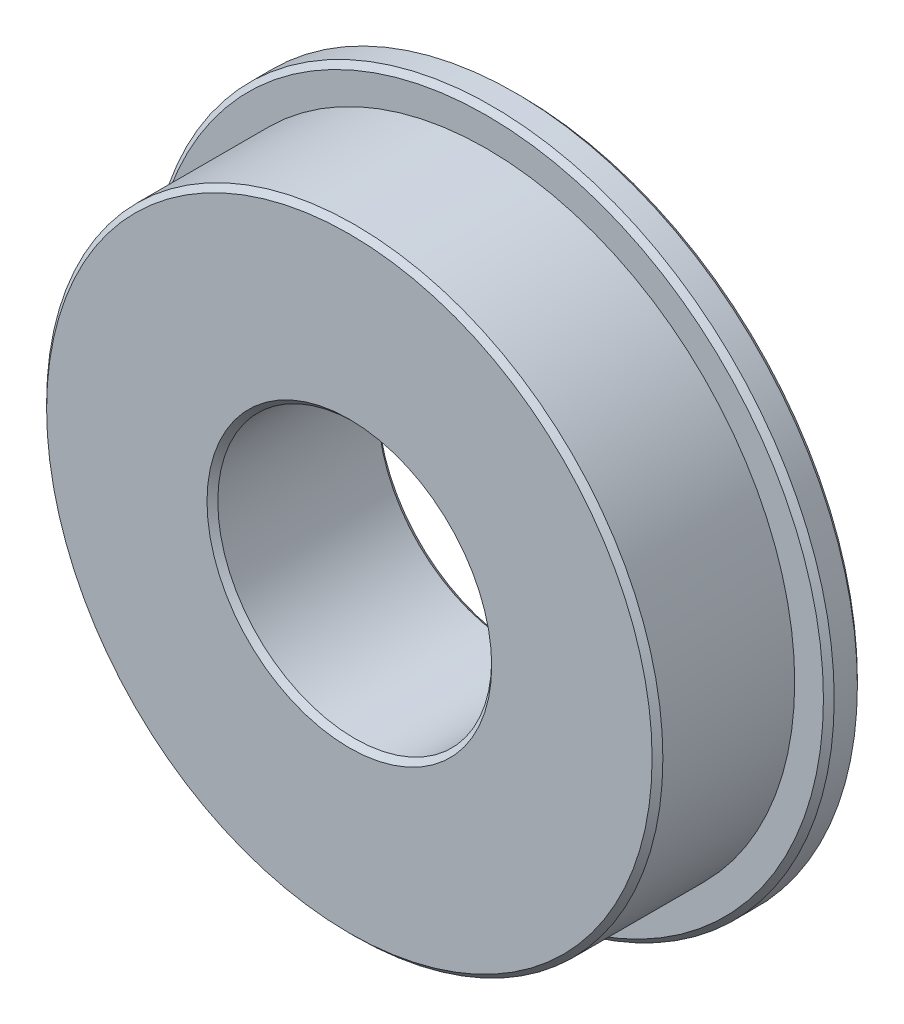
ISO-10303-21;
HEADER;
FILE_DESCRIPTION(('STEP AP214'),'2;1');
FILE_NAME('part.step','',(''),(''),'','','');
FILE_SCHEMA(('AUTOMOTIVE_DESIGN { 1 0 10303 214 1 1 1 1 }'));
ENDSEC;
DATA;
#1=APPLICATION_CONTEXT('core data for automotive mechanical design processes');
#2=APPLICATION_PROTOCOL_DEFINITION('international standard','automotive_design',2000,#1);
#3=PRODUCT_CONTEXT('',#1,'mechanical');
#4=PRODUCT('Part','Part','',(#3));
#5=PRODUCT_RELATED_PRODUCT_CATEGORY('part','',(#4));
#6=PRODUCT_DEFINITION_FORMATION('','',#4);
#7=PRODUCT_DEFINITION_CONTEXT('part definition',#1,'design');
#8=PRODUCT_DEFINITION('design','',#6,#7);
#9=PRODUCT_DEFINITION_SHAPE('','',#8);
#10=(LENGTH_UNIT() NAMED_UNIT(*) SI_UNIT(.MILLI.,.METRE.));
#11=(NAMED_UNIT(*) PLANE_ANGLE_UNIT() SI_UNIT($,.RADIAN.));
#12=(NAMED_UNIT(*) SI_UNIT($,.STERADIAN.) SOLID_ANGLE_UNIT());
#13=UNCERTAINTY_MEASURE_WITH_UNIT(LENGTH_MEASURE(1.E-05),#10,'distance_accuracy_value','');
#14=(GEOMETRIC_REPRESENTATION_CONTEXT(3) GLOBAL_UNCERTAINTY_ASSIGNED_CONTEXT((#13)) GLOBAL_UNIT_ASSIGNED_CONTEXT((#10,
#11,#12)) REPRESENTATION_CONTEXT('',''));
#15=CARTESIAN_POINT('',(0.,0.,0.));
#16=DIRECTION('',(0.,0.,1.));
#17=DIRECTION('',(1.,0.,0.));
#18=AXIS2_PLACEMENT_3D('',#15,#16,#17);
#19=CARTESIAN_POINT('',(-15.8687544862297,0.,-6.36269929073161));
#20=DIRECTION('',(0.,0.,-1.));
#21=DIRECTION('',(-1.,0.,0.));
#22=AXIS2_PLACEMENT_3D('',#19,#20,#21);
#23=PLANE('',#22);
#24=CARTESIAN_POINT('',(0.,0.,-6.36269929073161));
#25=DIRECTION('',(0.,0.,-1.));
#26=DIRECTION('',(-1.,0.,0.));
#27=AXIS2_PLACEMENT_3D('',#24,#25,#26);
#28=CIRCLE('',#27,15.6187544862297);
#29=CARTESIAN_POINT('',(-15.6187544862297,0.,-6.36269929073161));
#30=VERTEX_POINT('',#29);
#31=EDGE_CURVE('E10',#30,#30,#28,.F.);
#32=ORIENTED_EDGE('',*,*,#31,.T.);
#33=EDGE_LOOP('',(#32));
#34=FACE_BOUND('',#33,.T.);
#35=CARTESIAN_POINT('',(0.,0.,-6.36269929073161));
#36=DIRECTION('',(0.,0.,1.));
#37=DIRECTION('',(1.,0.,0.));
#38=AXIS2_PLACEMENT_3D('',#35,#36,#37);
#39=CIRCLE('',#38,14.2874972889093);
#40=CARTESIAN_POINT('',(14.2874972889093,0.,-6.36269929073161));
#41=VERTEX_POINT('',#40);
#42=EDGE_CURVE('E70',#41,#41,#39,.T.);
#43=ORIENTED_EDGE('',*,*,#42,.F.);
#44=EDGE_LOOP('',(#43));
#45=FACE_BOUND('',#44,.T.);
#46=ADVANCED_FACE('F32',(#34,#45),#23,.F.);
#47=CARTESIAN_POINT('',(0.,0.,0.));
#48=DIRECTION('',(0.,0.,1.));
#49=DIRECTION('',(1.,0.,0.));
#50=AXIS2_PLACEMENT_3D('',#47,#48,#49);
#51=CYLINDRICAL_SURFACE('',#50,15.8687544862297);
#52=CARTESIAN_POINT('',(0.,0.,-7.6874992907315));
#53=DIRECTION('',(0.,0.,1.));
#54=DIRECTION('',(1.,0.,0.));
#55=AXIS2_PLACEMENT_3D('',#52,#53,#54);
#56=CIRCLE('',#55,15.8687544862297);
#57=CARTESIAN_POINT('',(15.8687544862297,0.,-7.6874992907315));
#58=VERTEX_POINT('',#57);
#59=EDGE_CURVE('E39',#58,#58,#56,.T.);
#60=ORIENTED_EDGE('',*,*,#59,.T.);
#61=EDGE_LOOP('',(#60));
#62=FACE_BOUND('',#61,.T.);
#63=CARTESIAN_POINT('',(0.,0.,-6.61269929073161));
#64=DIRECTION('',(0.,0.,-1.));
#65=DIRECTION('',(-1.,0.,0.));
#66=AXIS2_PLACEMENT_3D('',#63,#64,#65);
#67=CIRCLE('',#66,15.8687544862297);
#68=CARTESIAN_POINT('',(-15.8687544862297,0.,-6.61269929073161));
#69=VERTEX_POINT('',#68);
#70=EDGE_CURVE('E43',#69,#69,#67,.T.);
#71=ORIENTED_EDGE('',*,*,#70,.T.);
#72=EDGE_LOOP('',(#71));
#73=FACE_BOUND('',#72,.T.);
#74=ADVANCED_FACE('F77',(#62,#73),#51,.T.);
#75=CARTESIAN_POINT('',(-6.34999793673862,0.,-7.93749929073151));
#76=DIRECTION('',(0.,0.,1.));
#77=DIRECTION('',(1.,0.,0.));
#78=AXIS2_PLACEMENT_3D('',#75,#76,#77);
#79=PLANE('',#78);
#80=CARTESIAN_POINT('',(0.,0.,-7.93749929073151));
#81=DIRECTION('',(0.,0.,1.));
#82=DIRECTION('',(1.,0.,0.));
#83=AXIS2_PLACEMENT_3D('',#80,#81,#82);
#84=CIRCLE('',#83,6.59999793673864);
#85=CARTESIAN_POINT('',(6.59999793673864,0.,-7.93749929073151));
#86=VERTEX_POINT('',#85);
#87=EDGE_CURVE('E47',#86,#86,#84,.T.);
#88=ORIENTED_EDGE('',*,*,#87,.T.);
#89=EDGE_LOOP('',(#88));
#90=FACE_BOUND('',#89,.T.);
#91=CARTESIAN_POINT('',(0.,0.,-7.93749929073151));
#92=DIRECTION('',(0.,0.,1.));
#93=DIRECTION('',(1.,0.,0.));
#94=AXIS2_PLACEMENT_3D('',#91,#92,#93);
#95=CIRCLE('',#94,15.6187544862297);
#96=CARTESIAN_POINT('',(15.6187544862297,0.,-7.93749929073151));
#97=VERTEX_POINT('',#96);
#98=EDGE_CURVE('E52',#97,#97,#95,.F.);
#99=ORIENTED_EDGE('',*,*,#98,.T.);
#100=EDGE_LOOP('',(#99));
#101=FACE_BOUND('',#100,.T.);
#102=ADVANCED_FACE('F82',(#90,#101),#79,.F.);
#103=CARTESIAN_POINT('',(0.,0.,0.));
#104=DIRECTION('',(0.,0.,1.));
#105=DIRECTION('',(1.,0.,0.));
#106=AXIS2_PLACEMENT_3D('',#103,#104,#105);
#107=CYLINDRICAL_SURFACE('',#106,6.34999793673862);
#108=CARTESIAN_POINT('',(0.,0.,-0.250000000000004));
#109=DIRECTION('',(0.,0.,-1.));
#110=DIRECTION('',(-1.,0.,0.));
#111=AXIS2_PLACEMENT_3D('',#108,#109,#110);
#112=CIRCLE('',#111,6.34999793673862);
#113=CARTESIAN_POINT('',(-6.34999793673862,0.,-0.250000000000004));
#114=VERTEX_POINT('',#113);
#115=EDGE_CURVE('E64',#114,#114,#112,.F.);
#116=ORIENTED_EDGE('',*,*,#115,.T.);
#117=EDGE_LOOP('',(#116));
#118=FACE_BOUND('',#117,.T.);
#119=CARTESIAN_POINT('',(0.,0.,-7.6874992907315));
#120=DIRECTION('',(0.,0.,1.));
#121=DIRECTION('',(1.,0.,0.));
#122=AXIS2_PLACEMENT_3D('',#119,#120,#121);
#123=CIRCLE('',#122,6.34999793673862);
#124=CARTESIAN_POINT('',(6.34999793673862,0.,-7.6874992907315));
#125=VERTEX_POINT('',#124);
#126=EDGE_CURVE('E67',#125,#125,#123,.F.);
#127=ORIENTED_EDGE('',*,*,#126,.T.);
#128=EDGE_LOOP('',(#127));
#129=FACE_BOUND('',#128,.T.);
#130=ADVANCED_FACE('F108',(#118,#129),#107,.F.);
#131=CARTESIAN_POINT('',(-14.2874972889093,0.,0.));
#132=DIRECTION('',(0.,0.,-1.));
#133=DIRECTION('',(-1.,0.,0.));
#134=AXIS2_PLACEMENT_3D('',#131,#132,#133);
#135=PLANE('',#134);
#136=CARTESIAN_POINT('',(0.,0.,0.));
#137=DIRECTION('',(0.,0.,-1.));
#138=DIRECTION('',(-1.,0.,0.));
#139=AXIS2_PLACEMENT_3D('',#136,#137,#138);
#140=CIRCLE('',#139,6.59999793673863);
#141=CARTESIAN_POINT('',(-6.59999793673863,0.,0.));
#142=VERTEX_POINT('',#141);
#143=EDGE_CURVE('E58',#142,#142,#140,.T.);
#144=ORIENTED_EDGE('',*,*,#143,.T.);
#145=EDGE_LOOP('',(#144));
#146=FACE_BOUND('',#145,.T.);
#147=CARTESIAN_POINT('',(0.,0.,0.));
#148=DIRECTION('',(0.,0.,-1.));
#149=DIRECTION('',(-1.,0.,0.));
#150=AXIS2_PLACEMENT_3D('',#147,#148,#149);
#151=CIRCLE('',#150,14.0374972889093);
#152=CARTESIAN_POINT('',(-14.0374972889093,0.,0.));
#153=VERTEX_POINT('',#152);
#154=EDGE_CURVE('E61',#153,#153,#151,.F.);
#155=ORIENTED_EDGE('',*,*,#154,.T.);
#156=EDGE_LOOP('',(#155));
#157=FACE_BOUND('',#156,.T.);
#158=ADVANCED_FACE('F113',(#146,#157),#135,.F.);
#159=CARTESIAN_POINT('',(0.,0.,0.));
#160=DIRECTION('',(0.,0.,1.));
#161=DIRECTION('',(1.,0.,0.));
#162=AXIS2_PLACEMENT_3D('',#159,#160,#161);
#163=CYLINDRICAL_SURFACE('',#162,14.2874972889093);
#164=CARTESIAN_POINT('',(0.,0.,-0.250000000000009));
#165=DIRECTION('',(0.,0.,-1.));
#166=DIRECTION('',(-1.,0.,0.));
#167=AXIS2_PLACEMENT_3D('',#164,#165,#166);
#168=CIRCLE('',#167,14.2874972889093);
#169=CARTESIAN_POINT('',(-14.2874972889093,0.,-0.250000000000009));
#170=VERTEX_POINT('',#169);
#171=EDGE_CURVE('E55',#170,#170,#168,.T.);
#172=ORIENTED_EDGE('',*,*,#171,.T.);
#173=EDGE_LOOP('',(#172));
#174=FACE_BOUND('',#173,.T.);
#175=ORIENTED_EDGE('',*,*,#42,.T.);
#176=EDGE_LOOP('',(#175));
#177=FACE_BOUND('',#176,.T.);
#178=ADVANCED_FACE('F74',(#174,#177),#163,.T.);
#179=CARTESIAN_POINT('',(0.,0.,-0.250000000000004));
#180=DIRECTION('',(0.,0.,1.));
#181=DIRECTION('',(1.,0.,0.));
#182=AXIS2_PLACEMENT_3D('',#179,#180,#181);
#183=CONICAL_SURFACE('',#182,6.34999793673862,0.785398163397447);
#184=ORIENTED_EDGE('',*,*,#143,.F.);
#185=EDGE_LOOP('',(#184));
#186=FACE_BOUND('',#185,.T.);
#187=ORIENTED_EDGE('',*,*,#115,.F.);
#188=EDGE_LOOP('',(#187));
#189=FACE_BOUND('',#188,.T.);
#190=ADVANCED_FACE('F86',(#186,#189),#183,.F.);
#191=CARTESIAN_POINT('',(0.,0.,0.));
#192=DIRECTION('',(0.,0.,-1.));
#193=DIRECTION('',(-1.,0.,0.));
#194=AXIS2_PLACEMENT_3D('',#191,#192,#193);
#195=CONICAL_SURFACE('',#194,14.0374972889093,0.785398163397462);
#196=ORIENTED_EDGE('',*,*,#171,.F.);
#197=EDGE_LOOP('',(#196));
#198=FACE_BOUND('',#197,.T.);
#199=ORIENTED_EDGE('',*,*,#154,.F.);
#200=EDGE_LOOP('',(#199));
#201=FACE_BOUND('',#200,.T.);
#202=ADVANCED_FACE('F89',(#198,#201),#195,.T.);
#203=CARTESIAN_POINT('',(0.,0.,-7.93749929073151));
#204=DIRECTION('',(0.,0.,-1.));
#205=DIRECTION('',(-1.,0.,0.));
#206=AXIS2_PLACEMENT_3D('',#203,#204,#205);
#207=CONICAL_SURFACE('',#206,6.59999793673864,0.78539816339745);
#208=ORIENTED_EDGE('',*,*,#126,.F.);
#209=EDGE_LOOP('',(#208));
#210=FACE_BOUND('',#209,.T.);
#211=ORIENTED_EDGE('',*,*,#87,.F.);
#212=EDGE_LOOP('',(#211));
#213=FACE_BOUND('',#212,.T.);
#214=ADVANCED_FACE('F93',(#210,#213),#207,.F.);
#215=CARTESIAN_POINT('',(0.,0.,-7.6874992907315));
#216=DIRECTION('',(0.,0.,1.));
#217=DIRECTION('',(1.,0.,0.));
#218=AXIS2_PLACEMENT_3D('',#215,#216,#217);
#219=CONICAL_SURFACE('',#218,15.8687544862297,0.785398163397462);
#220=ORIENTED_EDGE('',*,*,#98,.F.);
#221=EDGE_LOOP('',(#220));
#222=FACE_BOUND('',#221,.T.);
#223=ORIENTED_EDGE('',*,*,#59,.F.);
#224=EDGE_LOOP('',(#223));
#225=FACE_BOUND('',#224,.T.);
#226=ADVANCED_FACE('F96',(#222,#225),#219,.T.);
#227=CARTESIAN_POINT('',(0.,0.,-6.36269929073161));
#228=DIRECTION('',(0.,0.,-1.));
#229=DIRECTION('',(-1.,0.,0.));
#230=AXIS2_PLACEMENT_3D('',#227,#228,#229);
#231=CONICAL_SURFACE('',#230,15.6187544862297,0.785398163397448);
#232=ORIENTED_EDGE('',*,*,#70,.F.);
#233=EDGE_LOOP('',(#232));
#234=FACE_BOUND('',#233,.T.);
#235=ORIENTED_EDGE('',*,*,#31,.F.);
#236=EDGE_LOOP('',(#235));
#237=FACE_BOUND('',#236,.T.);
#238=ADVANCED_FACE('F34',(#234,#237),#231,.T.);
#239=CLOSED_SHELL('',(#46,#74,#102,#130,#158,#178,#190,#202,#214,#226,#238));
#240=MANIFOLD_SOLID_BREP('B2',#239);
#241=ADVANCED_BREP_SHAPE_REPRESENTATION('',(#18,#240),#14);
#242=SHAPE_DEFINITION_REPRESENTATION(#9,#241);
ENDSEC;
END-ISO-10303-21;
